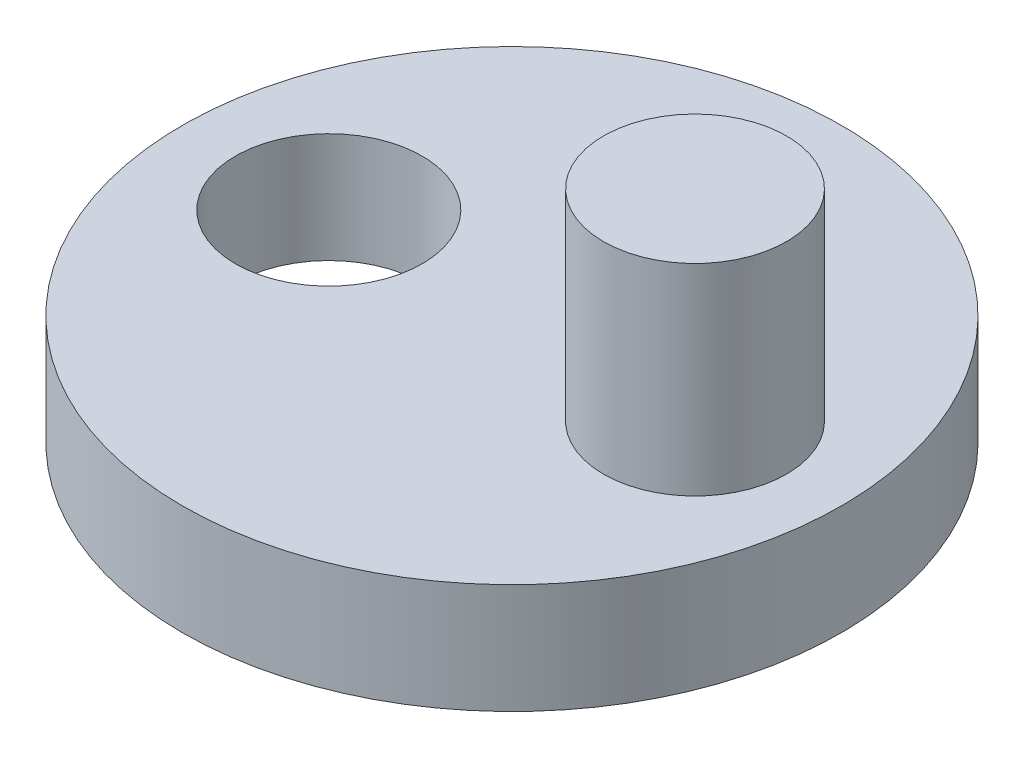
ISO-10303-21;
HEADER;
FILE_DESCRIPTION(('STEP AP214'),'2;1');
FILE_NAME('part.step','',(''),(''),'','','');
FILE_SCHEMA(('AUTOMOTIVE_DESIGN { 1 0 10303 214 1 1 1 1 }'));
ENDSEC;
DATA;
#1=APPLICATION_CONTEXT('core data for automotive mechanical design processes');
#2=APPLICATION_PROTOCOL_DEFINITION('international standard','automotive_design',2000,#1);
#3=PRODUCT_CONTEXT('',#1,'mechanical');
#4=PRODUCT('Part','Part','',(#3));
#5=PRODUCT_RELATED_PRODUCT_CATEGORY('part','',(#4));
#6=PRODUCT_DEFINITION_FORMATION('','',#4);
#7=PRODUCT_DEFINITION_CONTEXT('part definition',#1,'design');
#8=PRODUCT_DEFINITION('design','',#6,#7);
#9=PRODUCT_DEFINITION_SHAPE('','',#8);
#10=(LENGTH_UNIT() NAMED_UNIT(*) SI_UNIT(.MILLI.,.METRE.));
#11=(NAMED_UNIT(*) PLANE_ANGLE_UNIT() SI_UNIT($,.RADIAN.));
#12=(NAMED_UNIT(*) SI_UNIT($,.STERADIAN.) SOLID_ANGLE_UNIT());
#13=UNCERTAINTY_MEASURE_WITH_UNIT(LENGTH_MEASURE(1.E-05),#10,'distance_accuracy_value','');
#14=(GEOMETRIC_REPRESENTATION_CONTEXT(3) GLOBAL_UNCERTAINTY_ASSIGNED_CONTEXT((#13)) GLOBAL_UNIT_ASSIGNED_CONTEXT((#10,
#11,#12)) REPRESENTATION_CONTEXT('',''));
#15=CARTESIAN_POINT('',(0.,0.,0.));
#16=DIRECTION('',(0.,0.,1.));
#17=DIRECTION('',(1.,0.,0.));
#18=AXIS2_PLACEMENT_3D('',#15,#16,#17);
#19=CARTESIAN_POINT('',(0.,3.,0.));
#20=DIRECTION('',(0.,1.,0.));
#21=DIRECTION('',(0.,0.,1.));
#22=AXIS2_PLACEMENT_3D('',#19,#20,#21);
#23=PLANE('',#22);
#24=CARTESIAN_POINT('',(5.,3.,0.));
#25=DIRECTION('',(0.,1.,0.));
#26=DIRECTION('',(0.,0.,1.));
#27=AXIS2_PLACEMENT_3D('',#24,#25,#26);
#28=CIRCLE('',#27,2.5);
#29=CARTESIAN_POINT('',(5.,3.,2.5));
#30=VERTEX_POINT('',#29);
#31=EDGE_CURVE('E66',#30,#30,#28,.T.);
#32=ORIENTED_EDGE('',*,*,#31,.F.);
#33=EDGE_LOOP('',(#32));
#34=FACE_BOUND('',#33,.T.);
#35=CARTESIAN_POINT('',(0.,3.,0.));
#36=DIRECTION('',(0.,1.,0.));
#37=DIRECTION('',(0.,0.,1.));
#38=AXIS2_PLACEMENT_3D('',#35,#36,#37);
#39=CIRCLE('',#38,9.);
#40=CARTESIAN_POINT('',(0.,3.,9.));
#41=VERTEX_POINT('',#40);
#42=EDGE_CURVE('E10',#41,#41,#39,.T.);
#43=ORIENTED_EDGE('',*,*,#42,.T.);
#44=EDGE_LOOP('',(#43));
#45=FACE_BOUND('',#44,.T.);
#46=CARTESIAN_POINT('',(-5.,3.,0.000844512844806944));
#47=DIRECTION('',(0.,1.,0.));
#48=DIRECTION('',(0.,0.,1.));
#49=AXIS2_PLACEMENT_3D('',#46,#47,#48);
#50=CIRCLE('',#49,2.55);
#51=CARTESIAN_POINT('',(-5.,3.,2.55084451284481));
#52=VERTEX_POINT('',#51);
#53=EDGE_CURVE('E56',#52,#52,#50,.T.);
#54=ORIENTED_EDGE('',*,*,#53,.F.);
#55=EDGE_LOOP('',(#54));
#56=FACE_BOUND('',#55,.T.);
#57=ADVANCED_FACE('F43',(#34,#45,#56),#23,.T.);
#58=CARTESIAN_POINT('',(0.,0.,0.));
#59=DIRECTION('',(0.,1.,0.));
#60=DIRECTION('',(0.,0.,1.));
#61=AXIS2_PLACEMENT_3D('',#58,#59,#60);
#62=PLANE('',#61);
#63=CARTESIAN_POINT('',(0.,0.,0.));
#64=DIRECTION('',(0.,1.,0.));
#65=DIRECTION('',(0.,0.,1.));
#66=AXIS2_PLACEMENT_3D('',#63,#64,#65);
#67=CIRCLE('',#66,9.);
#68=CARTESIAN_POINT('',(0.,0.,9.));
#69=VERTEX_POINT('',#68);
#70=EDGE_CURVE('E47',#69,#69,#67,.T.);
#71=ORIENTED_EDGE('',*,*,#70,.F.);
#72=EDGE_LOOP('',(#71));
#73=FACE_BOUND('',#72,.T.);
#74=CARTESIAN_POINT('',(-5.,0.,0.000844512844806944));
#75=DIRECTION('',(0.,1.,0.));
#76=DIRECTION('',(0.,0.,1.));
#77=AXIS2_PLACEMENT_3D('',#74,#75,#76);
#78=CIRCLE('',#77,2.55);
#79=CARTESIAN_POINT('',(-5.,0.,2.55084451284481));
#80=VERTEX_POINT('',#79);
#81=EDGE_CURVE('E58',#80,#80,#78,.T.);
#82=ORIENTED_EDGE('',*,*,#81,.T.);
#83=EDGE_LOOP('',(#82));
#84=FACE_BOUND('',#83,.T.);
#85=ADVANCED_FACE('F84',(#73,#84),#62,.F.);
#86=CARTESIAN_POINT('',(0.,3.,0.));
#87=DIRECTION('',(0.,-1.,0.));
#88=DIRECTION('',(0.,0.,-1.));
#89=AXIS2_PLACEMENT_3D('',#86,#87,#88);
#90=CYLINDRICAL_SURFACE('',#89,9.);
#91=ORIENTED_EDGE('',*,*,#42,.F.);
#92=EDGE_LOOP('',(#91));
#93=FACE_BOUND('',#92,.T.);
#94=ORIENTED_EDGE('',*,*,#70,.T.);
#95=EDGE_LOOP('',(#94));
#96=FACE_BOUND('',#95,.T.);
#97=ADVANCED_FACE('F45',(#93,#96),#90,.T.);
#98=CARTESIAN_POINT('',(-5.,3.,0.000844512844806944));
#99=DIRECTION('',(0.,-1.,0.));
#100=DIRECTION('',(0.,0.,-1.));
#101=AXIS2_PLACEMENT_3D('',#98,#99,#100);
#102=CYLINDRICAL_SURFACE('',#101,2.55);
#103=ORIENTED_EDGE('',*,*,#53,.T.);
#104=EDGE_LOOP('',(#103));
#105=FACE_BOUND('',#104,.T.);
#106=ORIENTED_EDGE('',*,*,#81,.F.);
#107=EDGE_LOOP('',(#106));
#108=FACE_BOUND('',#107,.T.);
#109=ADVANCED_FACE('F79',(#105,#108),#102,.F.);
#110=CARTESIAN_POINT('',(5.,8.5,0.));
#111=DIRECTION('',(0.,-1.,0.));
#112=DIRECTION('',(0.,0.,-1.));
#113=AXIS2_PLACEMENT_3D('',#110,#111,#112);
#114=CYLINDRICAL_SURFACE('',#113,2.5);
#115=CARTESIAN_POINT('',(5.,8.5,0.));
#116=DIRECTION('',(0.,1.,0.));
#117=DIRECTION('',(0.,0.,1.));
#118=AXIS2_PLACEMENT_3D('',#115,#116,#117);
#119=CIRCLE('',#118,2.5);
#120=CARTESIAN_POINT('',(5.,8.5,2.5));
#121=VERTEX_POINT('',#120);
#122=EDGE_CURVE('E62',#121,#121,#119,.T.);
#123=ORIENTED_EDGE('',*,*,#122,.F.);
#124=EDGE_LOOP('',(#123));
#125=FACE_BOUND('',#124,.T.);
#126=ORIENTED_EDGE('',*,*,#31,.T.);
#127=EDGE_LOOP('',(#126));
#128=FACE_BOUND('',#127,.T.);
#129=ADVANCED_FACE('F76',(#125,#128),#114,.T.);
#130=CARTESIAN_POINT('',(5.,8.5,0.));
#131=DIRECTION('',(0.,1.,0.));
#132=DIRECTION('',(0.,0.,1.));
#133=AXIS2_PLACEMENT_3D('',#130,#131,#132);
#134=PLANE('',#133);
#135=ORIENTED_EDGE('',*,*,#122,.T.);
#136=EDGE_LOOP('',(#135));
#137=FACE_BOUND('',#136,.T.);
#138=ADVANCED_FACE('F74',(#137),#134,.T.);
#139=CLOSED_SHELL('',(#57,#85,#97,#109,#129,#138));
#140=MANIFOLD_SOLID_BREP('B2',#139);
#141=ADVANCED_BREP_SHAPE_REPRESENTATION('',(#18,#140),#14);
#142=SHAPE_DEFINITION_REPRESENTATION(#9,#141);
ENDSEC;
END-ISO-10303-21;
